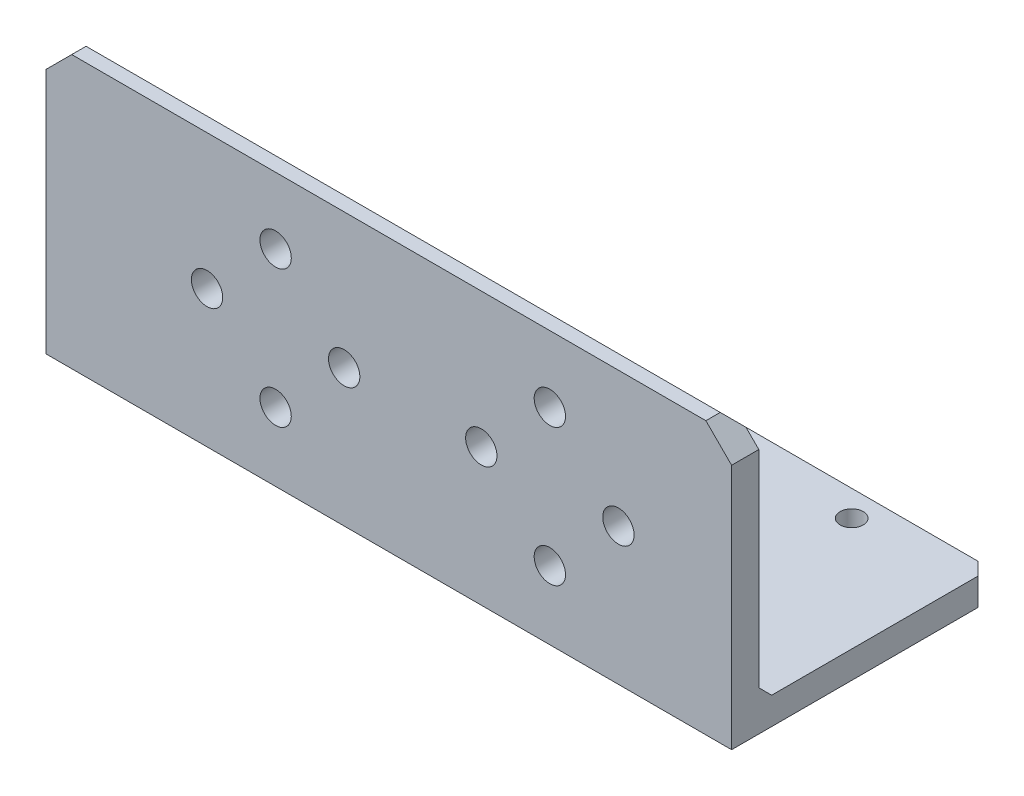
ISO-10303-21;
HEADER;
FILE_DESCRIPTION(('STEP AP214'),'2;1');
FILE_NAME('part.step','',(''),(''),'','','');
FILE_SCHEMA(('AUTOMOTIVE_DESIGN { 1 0 10303 214 1 1 1 1 }'));
ENDSEC;
DATA;
#1=APPLICATION_CONTEXT('core data for automotive mechanical design processes');
#2=APPLICATION_PROTOCOL_DEFINITION('international standard','automotive_design',2000,#1);
#3=PRODUCT_CONTEXT('',#1,'mechanical');
#4=PRODUCT('Part','Part','',(#3));
#5=PRODUCT_RELATED_PRODUCT_CATEGORY('part','',(#4));
#6=PRODUCT_DEFINITION_FORMATION('','',#4);
#7=PRODUCT_DEFINITION_CONTEXT('part definition',#1,'design');
#8=PRODUCT_DEFINITION('design','',#6,#7);
#9=PRODUCT_DEFINITION_SHAPE('','',#8);
#10=(LENGTH_UNIT() NAMED_UNIT(*) SI_UNIT(.MILLI.,.METRE.));
#11=(NAMED_UNIT(*) PLANE_ANGLE_UNIT() SI_UNIT($,.RADIAN.));
#12=(NAMED_UNIT(*) SI_UNIT($,.STERADIAN.) SOLID_ANGLE_UNIT());
#13=UNCERTAINTY_MEASURE_WITH_UNIT(LENGTH_MEASURE(1.E-05),#10,'distance_accuracy_value','');
#14=(GEOMETRIC_REPRESENTATION_CONTEXT(3) GLOBAL_UNCERTAINTY_ASSIGNED_CONTEXT((#13)) GLOBAL_UNIT_ASSIGNED_CONTEXT((#10,
#11,#12)) REPRESENTATION_CONTEXT('',''));
#15=CARTESIAN_POINT('',(0.,0.,0.));
#16=DIRECTION('',(0.,0.,1.));
#17=DIRECTION('',(1.,0.,0.));
#18=AXIS2_PLACEMENT_3D('',#15,#16,#17);
#19=CARTESIAN_POINT('',(40.,0.,0.));
#20=DIRECTION('',(0.,0.,-1.));
#21=DIRECTION('',(-1.,0.,0.));
#22=AXIS2_PLACEMENT_3D('',#19,#20,#21);
#23=PLANE('',#22);
#24=CARTESIAN_POINT('',(10.792,16.,0.));
#25=DIRECTION('',(0.,0.,-1.));
#26=DIRECTION('',(0.,1.,0.));
#27=AXIS2_PLACEMENT_3D('',#24,#25,#26);
#28=CIRCLE('',#27,1.8288);
#29=CARTESIAN_POINT('',(10.792,17.8288,0.));
#30=VERTEX_POINT('',#29);
#31=EDGE_CURVE('E382',#30,#30,#28,.T.);
#32=ORIENTED_EDGE('',*,*,#31,.T.);
#33=EDGE_LOOP('',(#32));
#34=FACE_BOUND('',#33,.T.);
#35=CARTESIAN_POINT('',(18.792,8.00000000000001,0.));
#36=DIRECTION('',(0.,0.,-1.));
#37=DIRECTION('',(0.,1.,0.));
#38=AXIS2_PLACEMENT_3D('',#35,#36,#37);
#39=CIRCLE('',#38,1.8288);
#40=CARTESIAN_POINT('',(18.792,9.82880000000001,0.));
#41=VERTEX_POINT('',#40);
#42=EDGE_CURVE('E392',#41,#41,#39,.T.);
#43=ORIENTED_EDGE('',*,*,#42,.T.);
#44=EDGE_LOOP('',(#43));
#45=FACE_BOUND('',#44,.T.);
#46=CARTESIAN_POINT('',(18.792,24.,0.));
#47=DIRECTION('',(0.,0.,-1.));
#48=DIRECTION('',(0.,1.,0.));
#49=AXIS2_PLACEMENT_3D('',#46,#47,#48);
#50=CIRCLE('',#49,1.8288);
#51=CARTESIAN_POINT('',(18.792,25.8288,0.));
#52=VERTEX_POINT('',#51);
#53=EDGE_CURVE('E398',#52,#52,#50,.T.);
#54=ORIENTED_EDGE('',*,*,#53,.T.);
#55=EDGE_LOOP('',(#54));
#56=FACE_BOUND('',#55,.T.);
#57=CARTESIAN_POINT('',(26.792,16.,0.));
#58=DIRECTION('',(0.,0.,-1.));
#59=DIRECTION('',(0.,1.,0.));
#60=AXIS2_PLACEMENT_3D('',#57,#58,#59);
#61=CIRCLE('',#60,1.8288);
#62=CARTESIAN_POINT('',(26.792,17.8288,0.));
#63=VERTEX_POINT('',#62);
#64=EDGE_CURVE('E404',#63,#63,#61,.T.);
#65=ORIENTED_EDGE('',*,*,#64,.T.);
#66=EDGE_LOOP('',(#65));
#67=FACE_BOUND('',#66,.T.);
#68=CARTESIAN_POINT('',(-13.208,24.,0.));
#69=DIRECTION('',(0.,0.,-1.));
#70=DIRECTION('',(0.,1.,0.));
#71=AXIS2_PLACEMENT_3D('',#68,#69,#70);
#72=CIRCLE('',#71,1.8288);
#73=CARTESIAN_POINT('',(-13.208,25.8288,0.));
#74=VERTEX_POINT('',#73);
#75=EDGE_CURVE('E410',#74,#74,#72,.T.);
#76=ORIENTED_EDGE('',*,*,#75,.T.);
#77=EDGE_LOOP('',(#76));
#78=FACE_BOUND('',#77,.T.);
#79=CARTESIAN_POINT('',(-5.20799999999996,16.,0.));
#80=DIRECTION('',(0.,0.,-1.));
#81=DIRECTION('',(0.,1.,0.));
#82=AXIS2_PLACEMENT_3D('',#79,#80,#81);
#83=CIRCLE('',#82,1.8288);
#84=CARTESIAN_POINT('',(-5.20799999999996,17.8288,0.));
#85=VERTEX_POINT('',#84);
#86=EDGE_CURVE('E416',#85,#85,#83,.T.);
#87=ORIENTED_EDGE('',*,*,#86,.T.);
#88=EDGE_LOOP('',(#87));
#89=FACE_BOUND('',#88,.T.);
#90=CARTESIAN_POINT('',(-13.208,8.00000000000001,0.));
#91=DIRECTION('',(0.,0.,-1.));
#92=DIRECTION('',(0.,1.,0.));
#93=AXIS2_PLACEMENT_3D('',#90,#91,#92);
#94=CIRCLE('',#93,1.8288);
#95=CARTESIAN_POINT('',(-13.208,9.82880000000001,0.));
#96=VERTEX_POINT('',#95);
#97=EDGE_CURVE('E422',#96,#96,#94,.T.);
#98=ORIENTED_EDGE('',*,*,#97,.T.);
#99=EDGE_LOOP('',(#98));
#100=FACE_BOUND('',#99,.T.);
#101=CARTESIAN_POINT('',(-21.208,16.,0.));
#102=DIRECTION('',(0.,0.,-1.));
#103=DIRECTION('',(0.,1.,0.));
#104=AXIS2_PLACEMENT_3D('',#101,#102,#103);
#105=CIRCLE('',#104,1.8288);
#106=CARTESIAN_POINT('',(-21.208,17.8288,0.));
#107=VERTEX_POINT('',#106);
#108=EDGE_CURVE('E428',#107,#107,#105,.T.);
#109=ORIENTED_EDGE('',*,*,#108,.T.);
#110=EDGE_LOOP('',(#109));
#111=FACE_BOUND('',#110,.T.);
#112=DIRECTION('',(-1.,0.,0.));
#113=VECTOR('',#112,1.);
#114=CARTESIAN_POINT('',(40.,31.75,0.));
#115=LINE('',#114,#113);
#116=CARTESIAN_POINT('',(37.,31.75,0.));
#117=VERTEX_POINT('',#116);
#118=CARTESIAN_POINT('',(-37.,31.75,0.));
#119=VERTEX_POINT('',#118);
#120=EDGE_CURVE('E172',#117,#119,#115,.T.);
#121=ORIENTED_EDGE('',*,*,#120,.T.);
#122=DIRECTION('',(-0.707106781186544,-0.707106781186551,0.));
#123=VECTOR('',#122,1.);
#124=CARTESIAN_POINT('',(-37.,31.75,0.));
#125=LINE('',#124,#123);
#126=CARTESIAN_POINT('',(-40.,28.75,0.));
#127=VERTEX_POINT('',#126);
#128=EDGE_CURVE('E202',#119,#127,#125,.T.);
#129=ORIENTED_EDGE('',*,*,#128,.T.);
#130=DIRECTION('',(0.,-1.,0.));
#131=VECTOR('',#130,1.);
#132=CARTESIAN_POINT('',(-40.,0.,0.));
#133=LINE('',#132,#131);
#134=CARTESIAN_POINT('',(-40.,0.,0.));
#135=VERTEX_POINT('',#134);
#136=EDGE_CURVE('E163',#127,#135,#133,.T.);
#137=ORIENTED_EDGE('',*,*,#136,.T.);
#138=DIRECTION('',(-1.,0.,0.));
#139=VECTOR('',#138,1.);
#140=CARTESIAN_POINT('',(40.,0.,0.));
#141=LINE('',#140,#139);
#142=CARTESIAN_POINT('',(40.,0.,0.));
#143=VERTEX_POINT('',#142);
#144=EDGE_CURVE('E158',#143,#135,#141,.T.);
#145=ORIENTED_EDGE('',*,*,#144,.F.);
#146=DIRECTION('',(0.,-1.,0.));
#147=VECTOR('',#146,1.);
#148=CARTESIAN_POINT('',(40.,0.,0.));
#149=LINE('',#148,#147);
#150=CARTESIAN_POINT('',(40.,28.75,0.));
#151=VERTEX_POINT('',#150);
#152=EDGE_CURVE('E146',#151,#143,#149,.T.);
#153=ORIENTED_EDGE('',*,*,#152,.F.);
#154=DIRECTION('',(0.707106781186551,-0.707106781186544,0.));
#155=VECTOR('',#154,1.);
#156=CARTESIAN_POINT('',(40.,28.75,0.));
#157=LINE('',#156,#155);
#158=EDGE_CURVE('E200',#151,#117,#157,.F.);
#159=ORIENTED_EDGE('',*,*,#158,.T.);
#160=EDGE_LOOP('',(#121,#129,#137,#145,#153,#159));
#161=FACE_BOUND('',#160,.T.);
#162=ADVANCED_FACE('F49',(#34,#45,#56,#67,#78,#89,#100,#111,#161),#23,.F.);
#163=CARTESIAN_POINT('',(40.,0.,0.));
#164=DIRECTION('',(0.,1.,0.));
#165=DIRECTION('',(0.,0.,1.));
#166=AXIS2_PLACEMENT_3D('',#163,#164,#165);
#167=PLANE('',#166);
#168=CARTESIAN_POINT('',(-37.2080000000001,0.,-27.221));
#169=DIRECTION('',(0.,1.,0.));
#170=DIRECTION('',(0.,0.,1.));
#171=AXIS2_PLACEMENT_3D('',#168,#169,#170);
#172=CIRCLE('',#171,1.35255);
#173=CARTESIAN_POINT('',(-37.2080000000001,0.,-25.86845));
#174=VERTEX_POINT('',#173);
#175=EDGE_CURVE('E434',#174,#174,#172,.T.);
#176=ORIENTED_EDGE('',*,*,#175,.T.);
#177=EDGE_LOOP('',(#176));
#178=FACE_BOUND('',#177,.T.);
#179=CARTESIAN_POINT('',(10.7919999999999,0.,-27.221));
#180=DIRECTION('',(0.,1.,0.));
#181=DIRECTION('',(0.,0.,1.));
#182=AXIS2_PLACEMENT_3D('',#179,#180,#181);
#183=CIRCLE('',#182,1.35255);
#184=CARTESIAN_POINT('',(10.7919999999999,0.,-25.86845));
#185=VERTEX_POINT('',#184);
#186=EDGE_CURVE('E440',#185,#185,#183,.T.);
#187=ORIENTED_EDGE('',*,*,#186,.T.);
#188=EDGE_LOOP('',(#187));
#189=FACE_BOUND('',#188,.T.);
#190=CARTESIAN_POINT('',(-5.20799999999993,0.,-27.221));
#191=DIRECTION('',(0.,1.,0.));
#192=DIRECTION('',(0.,0.,1.));
#193=AXIS2_PLACEMENT_3D('',#190,#191,#192);
#194=CIRCLE('',#193,1.35255);
#195=CARTESIAN_POINT('',(-5.20799999999993,0.,-25.86845));
#196=VERTEX_POINT('',#195);
#197=EDGE_CURVE('E446',#196,#196,#194,.T.);
#198=ORIENTED_EDGE('',*,*,#197,.T.);
#199=EDGE_LOOP('',(#198));
#200=FACE_BOUND('',#199,.T.);
#201=CARTESIAN_POINT('',(-13.2079999999999,0.,-19.221));
#202=DIRECTION('',(0.,1.,0.));
#203=DIRECTION('',(0.,0.,1.));
#204=AXIS2_PLACEMENT_3D('',#201,#202,#203);
#205=CIRCLE('',#204,1.35255);
#206=CARTESIAN_POINT('',(-13.2079999999999,0.,-17.86845));
#207=VERTEX_POINT('',#206);
#208=EDGE_CURVE('E452',#207,#207,#205,.T.);
#209=ORIENTED_EDGE('',*,*,#208,.T.);
#210=EDGE_LOOP('',(#209));
#211=FACE_BOUND('',#210,.T.);
#212=CARTESIAN_POINT('',(-21.2079999999999,0.,-27.221));
#213=DIRECTION('',(0.,1.,0.));
#214=DIRECTION('',(0.,0.,1.));
#215=AXIS2_PLACEMENT_3D('',#212,#213,#214);
#216=CIRCLE('',#215,1.35255);
#217=CARTESIAN_POINT('',(-21.2079999999999,0.,-25.86845));
#218=VERTEX_POINT('',#217);
#219=EDGE_CURVE('E458',#218,#218,#216,.T.);
#220=ORIENTED_EDGE('',*,*,#219,.T.);
#221=EDGE_LOOP('',(#220));
#222=FACE_BOUND('',#221,.T.);
#223=CARTESIAN_POINT('',(18.7919999999999,0.,-19.221));
#224=DIRECTION('',(0.,1.,0.));
#225=DIRECTION('',(0.,0.,1.));
#226=AXIS2_PLACEMENT_3D('',#223,#224,#225);
#227=CIRCLE('',#226,1.35255);
#228=CARTESIAN_POINT('',(18.7919999999999,0.,-17.86845));
#229=VERTEX_POINT('',#228);
#230=EDGE_CURVE('E464',#229,#229,#227,.T.);
#231=ORIENTED_EDGE('',*,*,#230,.T.);
#232=EDGE_LOOP('',(#231));
#233=FACE_BOUND('',#232,.T.);
#234=CARTESIAN_POINT('',(26.792,0.,-27.221));
#235=DIRECTION('',(0.,1.,0.));
#236=DIRECTION('',(0.,0.,1.));
#237=AXIS2_PLACEMENT_3D('',#234,#235,#236);
#238=CIRCLE('',#237,1.35255);
#239=CARTESIAN_POINT('',(26.792,0.,-25.86845));
#240=VERTEX_POINT('',#239);
#241=EDGE_CURVE('E255',#240,#240,#238,.T.);
#242=ORIENTED_EDGE('',*,*,#241,.T.);
#243=EDGE_LOOP('',(#242));
#244=FACE_BOUND('',#243,.T.);
#245=DIRECTION('',(0.,0.,-1.));
#246=VECTOR('',#245,1.);
#247=CARTESIAN_POINT('',(-40.,0.,0.));
#248=LINE('',#247,#246);
#249=CARTESIAN_POINT('',(-40.,0.,-28.75));
#250=VERTEX_POINT('',#249);
#251=EDGE_CURVE('E231',#135,#250,#248,.T.);
#252=ORIENTED_EDGE('',*,*,#251,.T.);
#253=DIRECTION('',(0.707106781186544,0.,-0.707106781186551));
#254=VECTOR('',#253,1.);
#255=CARTESIAN_POINT('',(-37.,0.,-31.75));
#256=LINE('',#255,#254);
#257=CARTESIAN_POINT('',(-37.,0.,-31.75));
#258=VERTEX_POINT('',#257);
#259=EDGE_CURVE('E229',#250,#258,#256,.T.);
#260=ORIENTED_EDGE('',*,*,#259,.T.);
#261=DIRECTION('',(-1.,0.,0.));
#262=VECTOR('',#261,1.);
#263=CARTESIAN_POINT('',(40.,0.,-31.75));
#264=LINE('',#263,#262);
#265=CARTESIAN_POINT('',(37.,0.,-31.75));
#266=VERTEX_POINT('',#265);
#267=EDGE_CURVE('E166',#266,#258,#264,.T.);
#268=ORIENTED_EDGE('',*,*,#267,.F.);
#269=DIRECTION('',(-0.707106781186551,0.,-0.707106781186544));
#270=VECTOR('',#269,1.);
#271=CARTESIAN_POINT('',(40.,0.,-28.75));
#272=LINE('',#271,#270);
#273=CARTESIAN_POINT('',(40.,0.,-28.75));
#274=VERTEX_POINT('',#273);
#275=EDGE_CURVE('E64',#266,#274,#272,.F.);
#276=ORIENTED_EDGE('',*,*,#275,.T.);
#277=DIRECTION('',(0.,0.,-1.));
#278=VECTOR('',#277,1.);
#279=CARTESIAN_POINT('',(40.,0.,0.));
#280=LINE('',#279,#278);
#281=EDGE_CURVE('E148',#143,#274,#280,.T.);
#282=ORIENTED_EDGE('',*,*,#281,.F.);
#283=ORIENTED_EDGE('',*,*,#144,.T.);
#284=EDGE_LOOP('',(#252,#260,#268,#276,#282,#283));
#285=FACE_BOUND('',#284,.T.);
#286=ADVANCED_FACE('F157',(#178,#189,#200,#211,#222,#233,#244,#285),#167,.F.);
#287=CARTESIAN_POINT('',(40.,0.,-31.75));
#288=DIRECTION('',(0.,0.,1.));
#289=DIRECTION('',(1.,0.,0.));
#290=AXIS2_PLACEMENT_3D('',#287,#288,#289);
#291=PLANE('',#290);
#292=ORIENTED_EDGE('',*,*,#267,.T.);
#293=DIRECTION('',(0.,1.,0.));
#294=VECTOR('',#293,1.);
#295=CARTESIAN_POINT('',(-37.,1.67499999999999,-31.75));
#296=LINE('',#295,#294);
#297=CARTESIAN_POINT('',(-37.,1.67499999999999,-31.75));
#298=VERTEX_POINT('',#297);
#299=EDGE_CURVE('E218',#258,#298,#296,.T.);
#300=ORIENTED_EDGE('',*,*,#299,.T.);
#301=DIRECTION('',(1.,0.,0.));
#302=VECTOR('',#301,1.);
#303=CARTESIAN_POINT('',(40.,1.67499999999999,-31.75));
#304=LINE('',#303,#302);
#305=CARTESIAN_POINT('',(37.,1.67499999999999,-31.75));
#306=VERTEX_POINT('',#305);
#307=EDGE_CURVE('E178',#298,#306,#304,.T.);
#308=ORIENTED_EDGE('',*,*,#307,.T.);
#309=DIRECTION('',(0.,-1.,0.));
#310=VECTOR('',#309,1.);
#311=CARTESIAN_POINT('',(37.,0.,-31.75));
#312=LINE('',#311,#310);
#313=EDGE_CURVE('E216',#306,#266,#312,.T.);
#314=ORIENTED_EDGE('',*,*,#313,.T.);
#315=EDGE_LOOP('',(#292,#300,#308,#314));
#316=FACE_BOUND('',#315,.T.);
#317=ADVANCED_FACE('F236',(#316),#291,.F.);
#318=CARTESIAN_POINT('',(40.,3.175,-31.75));
#319=DIRECTION('',(0.,-1.,0.));
#320=DIRECTION('',(0.,0.,-1.));
#321=AXIS2_PLACEMENT_3D('',#318,#319,#320);
#322=PLANE('',#321);
#323=CARTESIAN_POINT('',(-37.2080000000001,3.175,-27.221));
#324=DIRECTION('',(0.,1.,0.));
#325=DIRECTION('',(0.,0.,1.));
#326=AXIS2_PLACEMENT_3D('',#323,#324,#325);
#327=CIRCLE('',#326,1.35254999999999);
#328=CARTESIAN_POINT('',(-37.2080000000001,3.175,-25.86845));
#329=VERTEX_POINT('',#328);
#330=EDGE_CURVE('E431',#329,#329,#327,.T.);
#331=ORIENTED_EDGE('',*,*,#330,.F.);
#332=EDGE_LOOP('',(#331));
#333=FACE_BOUND('',#332,.T.);
#334=CARTESIAN_POINT('',(10.7919999999999,3.175,-27.221));
#335=DIRECTION('',(0.,1.,0.));
#336=DIRECTION('',(0.,0.,1.));
#337=AXIS2_PLACEMENT_3D('',#334,#335,#336);
#338=CIRCLE('',#337,1.35254999999999);
#339=CARTESIAN_POINT('',(10.7919999999999,3.175,-25.86845));
#340=VERTEX_POINT('',#339);
#341=EDGE_CURVE('E437',#340,#340,#338,.T.);
#342=ORIENTED_EDGE('',*,*,#341,.F.);
#343=EDGE_LOOP('',(#342));
#344=FACE_BOUND('',#343,.T.);
#345=CARTESIAN_POINT('',(-5.20799999999993,3.175,-27.221));
#346=DIRECTION('',(0.,1.,0.));
#347=DIRECTION('',(0.,0.,1.));
#348=AXIS2_PLACEMENT_3D('',#345,#346,#347);
#349=CIRCLE('',#348,1.35254999999999);
#350=CARTESIAN_POINT('',(-5.20799999999993,3.175,-25.86845));
#351=VERTEX_POINT('',#350);
#352=EDGE_CURVE('E443',#351,#351,#349,.T.);
#353=ORIENTED_EDGE('',*,*,#352,.F.);
#354=EDGE_LOOP('',(#353));
#355=FACE_BOUND('',#354,.T.);
#356=CARTESIAN_POINT('',(-13.2079999999999,3.17499999999999,-19.221));
#357=DIRECTION('',(0.,1.,0.));
#358=DIRECTION('',(0.,0.,1.));
#359=AXIS2_PLACEMENT_3D('',#356,#357,#358);
#360=CIRCLE('',#359,1.35254999999999);
#361=CARTESIAN_POINT('',(-13.2079999999999,3.17499999999999,-17.86845));
#362=VERTEX_POINT('',#361);
#363=EDGE_CURVE('E449',#362,#362,#360,.T.);
#364=ORIENTED_EDGE('',*,*,#363,.F.);
#365=EDGE_LOOP('',(#364));
#366=FACE_BOUND('',#365,.T.);
#367=CARTESIAN_POINT('',(-21.2079999999999,3.175,-27.221));
#368=DIRECTION('',(0.,1.,0.));
#369=DIRECTION('',(0.,0.,1.));
#370=AXIS2_PLACEMENT_3D('',#367,#368,#369);
#371=CIRCLE('',#370,1.35254999999999);
#372=CARTESIAN_POINT('',(-21.2079999999999,3.175,-25.86845));
#373=VERTEX_POINT('',#372);
#374=EDGE_CURVE('E455',#373,#373,#371,.T.);
#375=ORIENTED_EDGE('',*,*,#374,.F.);
#376=EDGE_LOOP('',(#375));
#377=FACE_BOUND('',#376,.T.);
#378=CARTESIAN_POINT('',(18.7919999999999,3.17499999999999,-19.221));
#379=DIRECTION('',(0.,1.,0.));
#380=DIRECTION('',(0.,0.,1.));
#381=AXIS2_PLACEMENT_3D('',#378,#379,#380);
#382=CIRCLE('',#381,1.35254999999999);
#383=CARTESIAN_POINT('',(18.7919999999999,3.17499999999999,-17.86845));
#384=VERTEX_POINT('',#383);
#385=EDGE_CURVE('E461',#384,#384,#382,.T.);
#386=ORIENTED_EDGE('',*,*,#385,.F.);
#387=EDGE_LOOP('',(#386));
#388=FACE_BOUND('',#387,.T.);
#389=CARTESIAN_POINT('',(26.792,3.175,-27.221));
#390=DIRECTION('',(0.,1.,0.));
#391=DIRECTION('',(0.,0.,1.));
#392=AXIS2_PLACEMENT_3D('',#389,#390,#391);
#393=CIRCLE('',#392,1.35254999999999);
#394=CARTESIAN_POINT('',(26.792,3.175,-25.86845));
#395=VERTEX_POINT('',#394);
#396=EDGE_CURVE('E467',#395,#395,#393,.T.);
#397=ORIENTED_EDGE('',*,*,#396,.F.);
#398=EDGE_LOOP('',(#397));
#399=FACE_BOUND('',#398,.T.);
#400=DIRECTION('',(-1.,0.,0.));
#401=VECTOR('',#400,1.);
#402=CARTESIAN_POINT('',(40.,3.175,-30.25));
#403=LINE('',#402,#401);
#404=CARTESIAN_POINT('',(38.5,3.175,-30.25));
#405=VERTEX_POINT('',#404);
#406=CARTESIAN_POINT('',(-38.5,3.175,-30.25));
#407=VERTEX_POINT('',#406);
#408=EDGE_CURVE('E169',#405,#407,#403,.T.);
#409=ORIENTED_EDGE('',*,*,#408,.T.);
#410=DIRECTION('',(-0.707106781186544,0.,0.707106781186551));
#411=VECTOR('',#410,1.);
#412=CARTESIAN_POINT('',(-37.,3.175,-31.75));
#413=LINE('',#412,#411);
#414=CARTESIAN_POINT('',(-40.,3.175,-28.75));
#415=VERTEX_POINT('',#414);
#416=EDGE_CURVE('E226',#407,#415,#413,.T.);
#417=ORIENTED_EDGE('',*,*,#416,.T.);
#418=DIRECTION('',(0.,0.,1.));
#419=VECTOR('',#418,1.);
#420=CARTESIAN_POINT('',(-40.,3.175,-31.75));
#421=LINE('',#420,#419);
#422=CARTESIAN_POINT('',(-40.,3.17499999999998,-4.67500000000002));
#423=VERTEX_POINT('',#422);
#424=EDGE_CURVE('E257',#415,#423,#421,.T.);
#425=ORIENTED_EDGE('',*,*,#424,.T.);
#426=DIRECTION('',(1.,0.,0.));
#427=VECTOR('',#426,1.);
#428=CARTESIAN_POINT('',(40.,3.17499999999998,-4.67500000000002));
#429=LINE('',#428,#427);
#430=CARTESIAN_POINT('',(40.,3.17499999999998,-4.67500000000002));
#431=VERTEX_POINT('',#430);
#432=EDGE_CURVE('E165',#423,#431,#429,.T.);
#433=ORIENTED_EDGE('',*,*,#432,.T.);
#434=DIRECTION('',(0.,0.,1.));
#435=VECTOR('',#434,1.);
#436=CARTESIAN_POINT('',(40.,3.175,-31.75));
#437=LINE('',#436,#435);
#438=CARTESIAN_POINT('',(40.,3.175,-28.75));
#439=VERTEX_POINT('',#438);
#440=EDGE_CURVE('E159',#439,#431,#437,.T.);
#441=ORIENTED_EDGE('',*,*,#440,.F.);
#442=DIRECTION('',(0.707106781186551,0.,0.707106781186544));
#443=VECTOR('',#442,1.);
#444=CARTESIAN_POINT('',(40.,3.175,-28.75));
#445=LINE('',#444,#443);
#446=EDGE_CURVE('E72',#439,#405,#445,.F.);
#447=ORIENTED_EDGE('',*,*,#446,.T.);
#448=EDGE_LOOP('',(#409,#417,#425,#433,#441,#447));
#449=FACE_BOUND('',#448,.T.);
#450=ADVANCED_FACE('F245',(#333,#344,#355,#366,#377,#388,#399,#449),#322,.F.);
#451=CARTESIAN_POINT('',(40.,31.75,-3.175));
#452=DIRECTION('',(0.,0.,1.));
#453=DIRECTION('',(0.,-1.,0.));
#454=AXIS2_PLACEMENT_3D('',#451,#452,#453);
#455=PLANE('',#454);
#456=CARTESIAN_POINT('',(10.792,16.,-3.17500000000001));
#457=DIRECTION('',(0.,0.,-1.));
#458=DIRECTION('',(0.,1.,0.));
#459=AXIS2_PLACEMENT_3D('',#456,#457,#458);
#460=CIRCLE('',#459,1.8288);
#461=CARTESIAN_POINT('',(10.792,17.8288,-3.175));
#462=VERTEX_POINT('',#461);
#463=EDGE_CURVE('E385',#462,#462,#460,.T.);
#464=ORIENTED_EDGE('',*,*,#463,.F.);
#465=EDGE_LOOP('',(#464));
#466=FACE_BOUND('',#465,.T.);
#467=CARTESIAN_POINT('',(18.792,8.00000000000001,-3.17500000000001));
#468=DIRECTION('',(0.,0.,-1.));
#469=DIRECTION('',(0.,1.,0.));
#470=AXIS2_PLACEMENT_3D('',#467,#468,#469);
#471=CIRCLE('',#470,1.8288);
#472=CARTESIAN_POINT('',(18.792,9.82880000000001,-3.17500000000001));
#473=VERTEX_POINT('',#472);
#474=EDGE_CURVE('E387',#473,#473,#471,.T.);
#475=ORIENTED_EDGE('',*,*,#474,.F.);
#476=EDGE_LOOP('',(#475));
#477=FACE_BOUND('',#476,.T.);
#478=CARTESIAN_POINT('',(18.792,24.,-3.175));
#479=DIRECTION('',(0.,0.,-1.));
#480=DIRECTION('',(0.,1.,0.));
#481=AXIS2_PLACEMENT_3D('',#478,#479,#480);
#482=CIRCLE('',#481,1.8288);
#483=CARTESIAN_POINT('',(18.792,25.8288,-3.175));
#484=VERTEX_POINT('',#483);
#485=EDGE_CURVE('E395',#484,#484,#482,.T.);
#486=ORIENTED_EDGE('',*,*,#485,.F.);
#487=EDGE_LOOP('',(#486));
#488=FACE_BOUND('',#487,.T.);
#489=CARTESIAN_POINT('',(26.792,16.,-3.17500000000001));
#490=DIRECTION('',(0.,0.,-1.));
#491=DIRECTION('',(0.,1.,0.));
#492=AXIS2_PLACEMENT_3D('',#489,#490,#491);
#493=CIRCLE('',#492,1.8288);
#494=CARTESIAN_POINT('',(26.792,17.8288,-3.175));
#495=VERTEX_POINT('',#494);
#496=EDGE_CURVE('E401',#495,#495,#493,.T.);
#497=ORIENTED_EDGE('',*,*,#496,.F.);
#498=EDGE_LOOP('',(#497));
#499=FACE_BOUND('',#498,.T.);
#500=CARTESIAN_POINT('',(-13.208,24.,-3.175));
#501=DIRECTION('',(0.,0.,-1.));
#502=DIRECTION('',(0.,1.,0.));
#503=AXIS2_PLACEMENT_3D('',#500,#501,#502);
#504=CIRCLE('',#503,1.8288);
#505=CARTESIAN_POINT('',(-13.208,25.8288,-3.175));
#506=VERTEX_POINT('',#505);
#507=EDGE_CURVE('E407',#506,#506,#504,.T.);
#508=ORIENTED_EDGE('',*,*,#507,.F.);
#509=EDGE_LOOP('',(#508));
#510=FACE_BOUND('',#509,.T.);
#511=CARTESIAN_POINT('',(-5.20799999999996,16.,-3.17500000000001));
#512=DIRECTION('',(0.,0.,-1.));
#513=DIRECTION('',(0.,1.,0.));
#514=AXIS2_PLACEMENT_3D('',#511,#512,#513);
#515=CIRCLE('',#514,1.8288);
#516=CARTESIAN_POINT('',(-5.20799999999996,17.8288,-3.175));
#517=VERTEX_POINT('',#516);
#518=EDGE_CURVE('E413',#517,#517,#515,.T.);
#519=ORIENTED_EDGE('',*,*,#518,.F.);
#520=EDGE_LOOP('',(#519));
#521=FACE_BOUND('',#520,.T.);
#522=CARTESIAN_POINT('',(-13.208,8.00000000000001,-3.17500000000001));
#523=DIRECTION('',(0.,0.,-1.));
#524=DIRECTION('',(0.,1.,0.));
#525=AXIS2_PLACEMENT_3D('',#522,#523,#524);
#526=CIRCLE('',#525,1.8288);
#527=CARTESIAN_POINT('',(-13.208,9.82880000000001,-3.17500000000001));
#528=VERTEX_POINT('',#527);
#529=EDGE_CURVE('E419',#528,#528,#526,.T.);
#530=ORIENTED_EDGE('',*,*,#529,.F.);
#531=EDGE_LOOP('',(#530));
#532=FACE_BOUND('',#531,.T.);
#533=CARTESIAN_POINT('',(-21.208,16.,-3.17500000000001));
#534=DIRECTION('',(0.,0.,-1.));
#535=DIRECTION('',(0.,1.,0.));
#536=AXIS2_PLACEMENT_3D('',#533,#534,#535);
#537=CIRCLE('',#536,1.8288);
#538=CARTESIAN_POINT('',(-21.208,17.8288,-3.175));
#539=VERTEX_POINT('',#538);
#540=EDGE_CURVE('E425',#539,#539,#537,.T.);
#541=ORIENTED_EDGE('',*,*,#540,.F.);
#542=EDGE_LOOP('',(#541));
#543=FACE_BOUND('',#542,.T.);
#544=DIRECTION('',(0.,1.,0.));
#545=VECTOR('',#544,1.);
#546=CARTESIAN_POINT('',(-40.,31.75,-3.175));
#547=LINE('',#546,#545);
#548=CARTESIAN_POINT('',(-40.,4.67500000000001,-3.17500000000001));
#549=VERTEX_POINT('',#548);
#550=CARTESIAN_POINT('',(-40.,28.75,-3.175));
#551=VERTEX_POINT('',#550);
#552=EDGE_CURVE('E153',#549,#551,#547,.T.);
#553=ORIENTED_EDGE('',*,*,#552,.T.);
#554=DIRECTION('',(0.707106781186544,0.707106781186551,0.));
#555=VECTOR('',#554,1.);
#556=CARTESIAN_POINT('',(-37.,31.75,-3.175));
#557=LINE('',#556,#555);
#558=CARTESIAN_POINT('',(-38.5,30.25,-3.175));
#559=VERTEX_POINT('',#558);
#560=EDGE_CURVE('E210',#551,#559,#557,.T.);
#561=ORIENTED_EDGE('',*,*,#560,.T.);
#562=DIRECTION('',(1.,0.,0.));
#563=VECTOR('',#562,1.);
#564=CARTESIAN_POINT('',(40.,30.25,-3.175));
#565=LINE('',#564,#563);
#566=CARTESIAN_POINT('',(38.5,30.25,-3.175));
#567=VERTEX_POINT('',#566);
#568=EDGE_CURVE('E181',#559,#567,#565,.T.);
#569=ORIENTED_EDGE('',*,*,#568,.T.);
#570=DIRECTION('',(-0.707106781186551,0.707106781186544,0.));
#571=VECTOR('',#570,1.);
#572=CARTESIAN_POINT('',(40.,28.75,-3.175));
#573=LINE('',#572,#571);
#574=CARTESIAN_POINT('',(40.,28.75,-3.175));
#575=VERTEX_POINT('',#574);
#576=EDGE_CURVE('E208',#567,#575,#573,.F.);
#577=ORIENTED_EDGE('',*,*,#576,.T.);
#578=DIRECTION('',(0.,1.,0.));
#579=VECTOR('',#578,1.);
#580=CARTESIAN_POINT('',(40.,31.75,-3.175));
#581=LINE('',#580,#579);
#582=CARTESIAN_POINT('',(40.,4.67500000000001,-3.17500000000001));
#583=VERTEX_POINT('',#582);
#584=EDGE_CURVE('E250',#583,#575,#581,.T.);
#585=ORIENTED_EDGE('',*,*,#584,.F.);
#586=DIRECTION('',(-1.,0.,0.));
#587=VECTOR('',#586,1.);
#588=CARTESIAN_POINT('',(-40.,4.67500000000001,-3.17500000000001));
#589=LINE('',#588,#587);
#590=EDGE_CURVE('E184',#583,#549,#589,.T.);
#591=ORIENTED_EDGE('',*,*,#590,.T.);
#592=EDGE_LOOP('',(#553,#561,#569,#577,#585,#591));
#593=FACE_BOUND('',#592,.T.);
#594=ADVANCED_FACE('F274',(#466,#477,#488,#499,#510,#521,#532,#543,#593),#455,.F.);
#595=CARTESIAN_POINT('',(40.,31.75,0.));
#596=DIRECTION('',(0.,-1.,0.));
#597=DIRECTION('',(0.,0.,-1.));
#598=AXIS2_PLACEMENT_3D('',#595,#596,#597);
#599=PLANE('',#598);
#600=DIRECTION('',(-1.,0.,0.));
#601=VECTOR('',#600,1.);
#602=CARTESIAN_POINT('',(40.,31.75,-1.675));
#603=LINE('',#602,#601);
#604=CARTESIAN_POINT('',(37.,31.75,-1.675));
#605=VERTEX_POINT('',#604);
#606=CARTESIAN_POINT('',(-37.,31.75,-1.675));
#607=VERTEX_POINT('',#606);
#608=EDGE_CURVE('E187',#605,#607,#603,.T.);
#609=ORIENTED_EDGE('',*,*,#608,.T.);
#610=DIRECTION('',(0.,0.,1.));
#611=VECTOR('',#610,1.);
#612=CARTESIAN_POINT('',(-37.,31.75,0.));
#613=LINE('',#612,#611);
#614=EDGE_CURVE('E197',#607,#119,#613,.T.);
#615=ORIENTED_EDGE('',*,*,#614,.T.);
#616=ORIENTED_EDGE('',*,*,#120,.F.);
#617=DIRECTION('',(0.,0.,-1.));
#618=VECTOR('',#617,1.);
#619=CARTESIAN_POINT('',(37.,31.75,0.));
#620=LINE('',#619,#618);
#621=EDGE_CURVE('E195',#117,#605,#620,.T.);
#622=ORIENTED_EDGE('',*,*,#621,.T.);
#623=EDGE_LOOP('',(#609,#615,#616,#622));
#624=FACE_BOUND('',#623,.T.);
#625=ADVANCED_FACE('F263',(#624),#599,.F.);
#626=CARTESIAN_POINT('',(40.,0.,0.));
#627=DIRECTION('',(-1.,0.,0.));
#628=DIRECTION('',(0.,0.,1.));
#629=AXIS2_PLACEMENT_3D('',#626,#627,#628);
#630=PLANE('',#629);
#631=ORIENTED_EDGE('',*,*,#281,.T.);
#632=DIRECTION('',(0.,1.,0.));
#633=VECTOR('',#632,1.);
#634=CARTESIAN_POINT('',(40.,0.,-28.75));
#635=LINE('',#634,#633);
#636=EDGE_CURVE('E13',#274,#439,#635,.T.);
#637=ORIENTED_EDGE('',*,*,#636,.T.);
#638=ORIENTED_EDGE('',*,*,#440,.T.);
#639=DIRECTION('',(0.,-0.707106781186551,-0.707106781186544));
#640=VECTOR('',#639,1.);
#641=CARTESIAN_POINT('',(40.,3.92499999999999,-3.92500000000003));
#642=LINE('',#641,#640);
#643=EDGE_CURVE('E193',#431,#583,#642,.F.);
#644=ORIENTED_EDGE('',*,*,#643,.T.);
#645=ORIENTED_EDGE('',*,*,#584,.T.);
#646=DIRECTION('',(0.,0.,1.));
#647=VECTOR('',#646,1.);
#648=CARTESIAN_POINT('',(40.,28.75,0.));
#649=LINE('',#648,#647);
#650=EDGE_CURVE('E57',#575,#151,#649,.T.);
#651=ORIENTED_EDGE('',*,*,#650,.T.);
#652=ORIENTED_EDGE('',*,*,#152,.T.);
#653=EDGE_LOOP('',(#631,#637,#638,#644,#645,#651,#652));
#654=FACE_BOUND('',#653,.T.);
#655=ADVANCED_FACE('F147',(#654),#630,.F.);
#656=CARTESIAN_POINT('',(-40.,0.,0.));
#657=DIRECTION('',(-1.,0.,0.));
#658=DIRECTION('',(0.,0.,1.));
#659=AXIS2_PLACEMENT_3D('',#656,#657,#658);
#660=PLANE('',#659);
#661=ORIENTED_EDGE('',*,*,#136,.F.);
#662=DIRECTION('',(0.,0.,-1.));
#663=VECTOR('',#662,1.);
#664=CARTESIAN_POINT('',(-40.,28.75,-1.675));
#665=LINE('',#664,#663);
#666=EDGE_CURVE('E206',#127,#551,#665,.T.);
#667=ORIENTED_EDGE('',*,*,#666,.T.);
#668=ORIENTED_EDGE('',*,*,#552,.F.);
#669=DIRECTION('',(0.,0.707106781186551,0.707106781186544));
#670=VECTOR('',#669,1.);
#671=CARTESIAN_POINT('',(-40.,4.67500000000001,-3.17500000000001));
#672=LINE('',#671,#670);
#673=EDGE_CURVE('E190',#549,#423,#672,.F.);
#674=ORIENTED_EDGE('',*,*,#673,.T.);
#675=ORIENTED_EDGE('',*,*,#424,.F.);
#676=DIRECTION('',(0.,-1.,0.));
#677=VECTOR('',#676,1.);
#678=CARTESIAN_POINT('',(-40.,0.,-28.75));
#679=LINE('',#678,#677);
#680=EDGE_CURVE('E204',#415,#250,#679,.T.);
#681=ORIENTED_EDGE('',*,*,#680,.T.);
#682=ORIENTED_EDGE('',*,*,#251,.F.);
#683=EDGE_LOOP('',(#661,#667,#668,#674,#675,#681,#682));
#684=FACE_BOUND('',#683,.T.);
#685=ADVANCED_FACE('F282',(#684),#660,.T.);
#686=CARTESIAN_POINT('',(40.,3.175,-30.25));
#687=DIRECTION('',(0.,-0.707106781186544,0.707106781186551));
#688=DIRECTION('',(-1.,0.,0.));
#689=AXIS2_PLACEMENT_3D('',#686,#687,#688);
#690=PLANE('',#689);
#691=ORIENTED_EDGE('',*,*,#307,.F.);
#692=DIRECTION('',(0.577350269189621,-0.577350269189631,-0.577350269189626));
#693=VECTOR('',#692,1.);
#694=CARTESIAN_POINT('',(-12.3333333333338,-22.9916666666667,-56.4166666666664));
#695=LINE('',#694,#693);
#696=EDGE_CURVE('E223',#298,#407,#695,.F.);
#697=ORIENTED_EDGE('',*,*,#696,.T.);
#698=ORIENTED_EDGE('',*,*,#408,.F.);
#699=DIRECTION('',(-0.577350269189628,-0.577350269189628,-0.577350269189622));
#700=VECTOR('',#699,1.);
#701=CARTESIAN_POINT('',(39.,3.675,-29.75));
#702=LINE('',#701,#700);
#703=EDGE_CURVE('E221',#405,#306,#702,.T.);
#704=ORIENTED_EDGE('',*,*,#703,.T.);
#705=EDGE_LOOP('',(#691,#697,#698,#704));
#706=FACE_BOUND('',#705,.T.);
#707=ADVANCED_FACE('F243',(#706),#690,.F.);
#708=CARTESIAN_POINT('',(40.,4.67500000000001,-3.17500000000001));
#709=DIRECTION('',(0.,0.707106781186544,-0.707106781186551));
#710=DIRECTION('',(1.,0.,0.));
#711=AXIS2_PLACEMENT_3D('',#708,#709,#710);
#712=PLANE('',#711);
#713=ORIENTED_EDGE('',*,*,#643,.F.);
#714=ORIENTED_EDGE('',*,*,#432,.F.);
#715=ORIENTED_EDGE('',*,*,#673,.F.);
#716=ORIENTED_EDGE('',*,*,#590,.F.);
#717=EDGE_LOOP('',(#713,#714,#715,#716));
#718=FACE_BOUND('',#717,.T.);
#719=ADVANCED_FACE('F285',(#718),#712,.T.);
#720=CARTESIAN_POINT('',(40.,31.75,-1.675));
#721=DIRECTION('',(0.,-0.707106781186547,0.707106781186547));
#722=DIRECTION('',(-1.,0.,0.));
#723=AXIS2_PLACEMENT_3D('',#720,#721,#722);
#724=PLANE('',#723);
#725=ORIENTED_EDGE('',*,*,#568,.F.);
#726=DIRECTION('',(-0.577350269189622,-0.577350269189628,-0.577350269189628));
#727=VECTOR('',#726,1.);
#728=CARTESIAN_POINT('',(-11.3333333333336,57.4166666666666,23.9916666666666));
#729=LINE('',#728,#727);
#730=EDGE_CURVE('E214',#559,#607,#729,.F.);
#731=ORIENTED_EDGE('',*,*,#730,.T.);
#732=ORIENTED_EDGE('',*,*,#608,.F.);
#733=DIRECTION('',(0.577350269189629,-0.577350269189624,-0.577350269189624));
#734=VECTOR('',#733,1.);
#735=CARTESIAN_POINT('',(38.,30.75,-2.67500000000001));
#736=LINE('',#735,#734);
#737=EDGE_CURVE('E212',#605,#567,#736,.T.);
#738=ORIENTED_EDGE('',*,*,#737,.T.);
#739=EDGE_LOOP('',(#725,#731,#732,#738));
#740=FACE_BOUND('',#739,.T.);
#741=ADVANCED_FACE('F271',(#740),#724,.F.);
#742=CARTESIAN_POINT('',(-37.,31.75,0.));
#743=DIRECTION('',(-0.707106781186551,0.707106781186544,0.));
#744=DIRECTION('',(0.,0.,-1.));
#745=AXIS2_PLACEMENT_3D('',#742,#743,#744);
#746=PLANE('',#745);
#747=ORIENTED_EDGE('',*,*,#560,.F.);
#748=ORIENTED_EDGE('',*,*,#666,.F.);
#749=ORIENTED_EDGE('',*,*,#128,.F.);
#750=ORIENTED_EDGE('',*,*,#614,.F.);
#751=ORIENTED_EDGE('',*,*,#730,.F.);
#752=EDGE_LOOP('',(#747,#748,#749,#750,#751));
#753=FACE_BOUND('',#752,.T.);
#754=ADVANCED_FACE('F280',(#753),#746,.T.);
#755=CARTESIAN_POINT('',(-37.,0.,-31.75));
#756=DIRECTION('',(-0.707106781186551,0.,-0.707106781186544));
#757=DIRECTION('',(0.,-1.,0.));
#758=AXIS2_PLACEMENT_3D('',#755,#756,#757);
#759=PLANE('',#758);
#760=ORIENTED_EDGE('',*,*,#259,.F.);
#761=ORIENTED_EDGE('',*,*,#680,.F.);
#762=ORIENTED_EDGE('',*,*,#416,.F.);
#763=ORIENTED_EDGE('',*,*,#696,.F.);
#764=ORIENTED_EDGE('',*,*,#299,.F.);
#765=EDGE_LOOP('',(#760,#761,#762,#763,#764));
#766=FACE_BOUND('',#765,.T.);
#767=ADVANCED_FACE('F239',(#766),#759,.T.);
#768=CARTESIAN_POINT('',(40.,0.,-28.75));
#769=DIRECTION('',(-0.707106781186544,0.,0.707106781186551));
#770=DIRECTION('',(0.,1.,0.));
#771=AXIS2_PLACEMENT_3D('',#768,#769,#770);
#772=PLANE('',#771);
#773=ORIENTED_EDGE('',*,*,#275,.F.);
#774=ORIENTED_EDGE('',*,*,#313,.F.);
#775=ORIENTED_EDGE('',*,*,#703,.F.);
#776=ORIENTED_EDGE('',*,*,#446,.F.);
#777=ORIENTED_EDGE('',*,*,#636,.F.);
#778=EDGE_LOOP('',(#773,#774,#775,#776,#777));
#779=FACE_BOUND('',#778,.T.);
#780=ADVANCED_FACE('F602',(#779),#772,.F.);
#781=CARTESIAN_POINT('',(40.,28.75,0.));
#782=DIRECTION('',(-0.707106781186544,-0.707106781186551,0.));
#783=DIRECTION('',(0.,0.,1.));
#784=AXIS2_PLACEMENT_3D('',#781,#782,#783);
#785=PLANE('',#784);
#786=ORIENTED_EDGE('',*,*,#737,.F.);
#787=ORIENTED_EDGE('',*,*,#621,.F.);
#788=ORIENTED_EDGE('',*,*,#158,.F.);
#789=ORIENTED_EDGE('',*,*,#650,.F.);
#790=ORIENTED_EDGE('',*,*,#576,.F.);
#791=EDGE_LOOP('',(#786,#787,#788,#789,#790));
#792=FACE_BOUND('',#791,.T.);
#793=ADVANCED_FACE('F51',(#792),#785,.F.);
#794=CARTESIAN_POINT('',(26.792,3.17499999999999,-27.221));
#795=DIRECTION('',(0.,1.,0.));
#796=DIRECTION('',(0.,0.,1.));
#797=AXIS2_PLACEMENT_3D('',#794,#795,#796);
#798=CYLINDRICAL_SURFACE('',#797,1.35254999999999);
#799=ORIENTED_EDGE('',*,*,#241,.F.);
#800=EDGE_LOOP('',(#799));
#801=FACE_BOUND('',#800,.T.);
#802=ORIENTED_EDGE('',*,*,#396,.T.);
#803=EDGE_LOOP('',(#802));
#804=FACE_BOUND('',#803,.T.);
#805=ADVANCED_FACE('F319',(#801,#804),#798,.F.);
#806=CARTESIAN_POINT('',(18.7919999999999,3.17499999999999,-19.221));
#807=DIRECTION('',(0.,1.,0.));
#808=DIRECTION('',(0.,0.,1.));
#809=AXIS2_PLACEMENT_3D('',#806,#807,#808);
#810=CYLINDRICAL_SURFACE('',#809,1.35254999999999);
#811=ORIENTED_EDGE('',*,*,#230,.F.);
#812=EDGE_LOOP('',(#811));
#813=FACE_BOUND('',#812,.T.);
#814=ORIENTED_EDGE('',*,*,#385,.T.);
#815=EDGE_LOOP('',(#814));
#816=FACE_BOUND('',#815,.T.);
#817=ADVANCED_FACE('F322',(#813,#816),#810,.F.);
#818=CARTESIAN_POINT('',(-21.2079999999999,3.17499999999999,-27.221));
#819=DIRECTION('',(0.,1.,0.));
#820=DIRECTION('',(0.,0.,1.));
#821=AXIS2_PLACEMENT_3D('',#818,#819,#820);
#822=CYLINDRICAL_SURFACE('',#821,1.35254999999999);
#823=ORIENTED_EDGE('',*,*,#219,.F.);
#824=EDGE_LOOP('',(#823));
#825=FACE_BOUND('',#824,.T.);
#826=ORIENTED_EDGE('',*,*,#374,.T.);
#827=EDGE_LOOP('',(#826));
#828=FACE_BOUND('',#827,.T.);
#829=ADVANCED_FACE('F326',(#825,#828),#822,.F.);
#830=CARTESIAN_POINT('',(-13.2079999999999,3.17499999999999,-19.221));
#831=DIRECTION('',(0.,1.,0.));
#832=DIRECTION('',(0.,0.,1.));
#833=AXIS2_PLACEMENT_3D('',#830,#831,#832);
#834=CYLINDRICAL_SURFACE('',#833,1.35254999999999);
#835=ORIENTED_EDGE('',*,*,#208,.F.);
#836=EDGE_LOOP('',(#835));
#837=FACE_BOUND('',#836,.T.);
#838=ORIENTED_EDGE('',*,*,#363,.T.);
#839=EDGE_LOOP('',(#838));
#840=FACE_BOUND('',#839,.T.);
#841=ADVANCED_FACE('F330',(#837,#840),#834,.F.);
#842=CARTESIAN_POINT('',(-5.20799999999993,3.17499999999999,-27.221));
#843=DIRECTION('',(0.,1.,0.));
#844=DIRECTION('',(0.,0.,1.));
#845=AXIS2_PLACEMENT_3D('',#842,#843,#844);
#846=CYLINDRICAL_SURFACE('',#845,1.35254999999999);
#847=ORIENTED_EDGE('',*,*,#197,.F.);
#848=EDGE_LOOP('',(#847));
#849=FACE_BOUND('',#848,.T.);
#850=ORIENTED_EDGE('',*,*,#352,.T.);
#851=EDGE_LOOP('',(#850));
#852=FACE_BOUND('',#851,.T.);
#853=ADVANCED_FACE('F334',(#849,#852),#846,.F.);
#854=CARTESIAN_POINT('',(10.7919999999999,3.17499999999999,-27.221));
#855=DIRECTION('',(0.,1.,0.));
#856=DIRECTION('',(0.,0.,1.));
#857=AXIS2_PLACEMENT_3D('',#854,#855,#856);
#858=CYLINDRICAL_SURFACE('',#857,1.35254999999999);
#859=ORIENTED_EDGE('',*,*,#186,.F.);
#860=EDGE_LOOP('',(#859));
#861=FACE_BOUND('',#860,.T.);
#862=ORIENTED_EDGE('',*,*,#341,.T.);
#863=EDGE_LOOP('',(#862));
#864=FACE_BOUND('',#863,.T.);
#865=ADVANCED_FACE('F338',(#861,#864),#858,.F.);
#866=CARTESIAN_POINT('',(-37.2080000000001,3.17499999999999,-27.221));
#867=DIRECTION('',(0.,1.,0.));
#868=DIRECTION('',(0.,0.,1.));
#869=AXIS2_PLACEMENT_3D('',#866,#867,#868);
#870=CYLINDRICAL_SURFACE('',#869,1.35254999999999);
#871=ORIENTED_EDGE('',*,*,#175,.F.);
#872=EDGE_LOOP('',(#871));
#873=FACE_BOUND('',#872,.T.);
#874=ORIENTED_EDGE('',*,*,#330,.T.);
#875=EDGE_LOOP('',(#874));
#876=FACE_BOUND('',#875,.T.);
#877=ADVANCED_FACE('F342',(#873,#876),#870,.F.);
#878=CARTESIAN_POINT('',(-21.208,16.,-3.17500000000001));
#879=DIRECTION('',(0.,0.,-1.));
#880=DIRECTION('',(0.,1.,0.));
#881=AXIS2_PLACEMENT_3D('',#878,#879,#880);
#882=CYLINDRICAL_SURFACE('',#881,1.8288);
#883=ORIENTED_EDGE('',*,*,#108,.F.);
#884=EDGE_LOOP('',(#883));
#885=FACE_BOUND('',#884,.T.);
#886=ORIENTED_EDGE('',*,*,#540,.T.);
#887=EDGE_LOOP('',(#886));
#888=FACE_BOUND('',#887,.T.);
#889=ADVANCED_FACE('F346',(#885,#888),#882,.F.);
#890=CARTESIAN_POINT('',(-13.208,8.00000000000001,-3.17500000000001));
#891=DIRECTION('',(0.,0.,-1.));
#892=DIRECTION('',(0.,1.,0.));
#893=AXIS2_PLACEMENT_3D('',#890,#891,#892);
#894=CYLINDRICAL_SURFACE('',#893,1.8288);
#895=ORIENTED_EDGE('',*,*,#97,.F.);
#896=EDGE_LOOP('',(#895));
#897=FACE_BOUND('',#896,.T.);
#898=ORIENTED_EDGE('',*,*,#529,.T.);
#899=EDGE_LOOP('',(#898));
#900=FACE_BOUND('',#899,.T.);
#901=ADVANCED_FACE('F350',(#897,#900),#894,.F.);
#902=CARTESIAN_POINT('',(-5.20799999999996,16.,-3.17500000000001));
#903=DIRECTION('',(0.,0.,-1.));
#904=DIRECTION('',(0.,1.,0.));
#905=AXIS2_PLACEMENT_3D('',#902,#903,#904);
#906=CYLINDRICAL_SURFACE('',#905,1.8288);
#907=ORIENTED_EDGE('',*,*,#86,.F.);
#908=EDGE_LOOP('',(#907));
#909=FACE_BOUND('',#908,.T.);
#910=ORIENTED_EDGE('',*,*,#518,.T.);
#911=EDGE_LOOP('',(#910));
#912=FACE_BOUND('',#911,.T.);
#913=ADVANCED_FACE('F354',(#909,#912),#906,.F.);
#914=CARTESIAN_POINT('',(-13.208,24.,-3.175));
#915=DIRECTION('',(0.,0.,-1.));
#916=DIRECTION('',(0.,1.,0.));
#917=AXIS2_PLACEMENT_3D('',#914,#915,#916);
#918=CYLINDRICAL_SURFACE('',#917,1.8288);
#919=ORIENTED_EDGE('',*,*,#75,.F.);
#920=EDGE_LOOP('',(#919));
#921=FACE_BOUND('',#920,.T.);
#922=ORIENTED_EDGE('',*,*,#507,.T.);
#923=EDGE_LOOP('',(#922));
#924=FACE_BOUND('',#923,.T.);
#925=ADVANCED_FACE('F358',(#921,#924),#918,.F.);
#926=CARTESIAN_POINT('',(26.792,16.,-3.17500000000001));
#927=DIRECTION('',(0.,0.,-1.));
#928=DIRECTION('',(0.,1.,0.));
#929=AXIS2_PLACEMENT_3D('',#926,#927,#928);
#930=CYLINDRICAL_SURFACE('',#929,1.8288);
#931=ORIENTED_EDGE('',*,*,#64,.F.);
#932=EDGE_LOOP('',(#931));
#933=FACE_BOUND('',#932,.T.);
#934=ORIENTED_EDGE('',*,*,#496,.T.);
#935=EDGE_LOOP('',(#934));
#936=FACE_BOUND('',#935,.T.);
#937=ADVANCED_FACE('F362',(#933,#936),#930,.F.);
#938=CARTESIAN_POINT('',(18.792,24.,-3.175));
#939=DIRECTION('',(0.,0.,-1.));
#940=DIRECTION('',(0.,1.,0.));
#941=AXIS2_PLACEMENT_3D('',#938,#939,#940);
#942=CYLINDRICAL_SURFACE('',#941,1.8288);
#943=ORIENTED_EDGE('',*,*,#53,.F.);
#944=EDGE_LOOP('',(#943));
#945=FACE_BOUND('',#944,.T.);
#946=ORIENTED_EDGE('',*,*,#485,.T.);
#947=EDGE_LOOP('',(#946));
#948=FACE_BOUND('',#947,.T.);
#949=ADVANCED_FACE('F366',(#945,#948),#942,.F.);
#950=CARTESIAN_POINT('',(18.792,8.00000000000001,-3.17500000000001));
#951=DIRECTION('',(0.,0.,-1.));
#952=DIRECTION('',(0.,1.,0.));
#953=AXIS2_PLACEMENT_3D('',#950,#951,#952);
#954=CYLINDRICAL_SURFACE('',#953,1.8288);
#955=ORIENTED_EDGE('',*,*,#42,.F.);
#956=EDGE_LOOP('',(#955));
#957=FACE_BOUND('',#956,.T.);
#958=ORIENTED_EDGE('',*,*,#474,.T.);
#959=EDGE_LOOP('',(#958));
#960=FACE_BOUND('',#959,.T.);
#961=ADVANCED_FACE('F370',(#957,#960),#954,.F.);
#962=CARTESIAN_POINT('',(10.792,16.,-3.17500000000001));
#963=DIRECTION('',(0.,0.,-1.));
#964=DIRECTION('',(0.,1.,0.));
#965=AXIS2_PLACEMENT_3D('',#962,#963,#964);
#966=CYLINDRICAL_SURFACE('',#965,1.8288);
#967=ORIENTED_EDGE('',*,*,#31,.F.);
#968=EDGE_LOOP('',(#967));
#969=FACE_BOUND('',#968,.T.);
#970=ORIENTED_EDGE('',*,*,#463,.T.);
#971=EDGE_LOOP('',(#970));
#972=FACE_BOUND('',#971,.T.);
#973=ADVANCED_FACE('F374',(#969,#972),#966,.F.);
#974=CLOSED_SHELL('',(#162,#286,#317,#450,#594,#625,#655,#685,#707,#719,#741,#754,#767,#780,
#793,#805,#817,#829,#841,#853,#865,#877,#889,#901,#913,#925,#937,#949,#961,#973));
#975=MANIFOLD_SOLID_BREP('B2',#974);
#976=ADVANCED_BREP_SHAPE_REPRESENTATION('',(#18,#975),#14);
#977=SHAPE_DEFINITION_REPRESENTATION(#9,#976);
ENDSEC;
END-ISO-10303-21;
